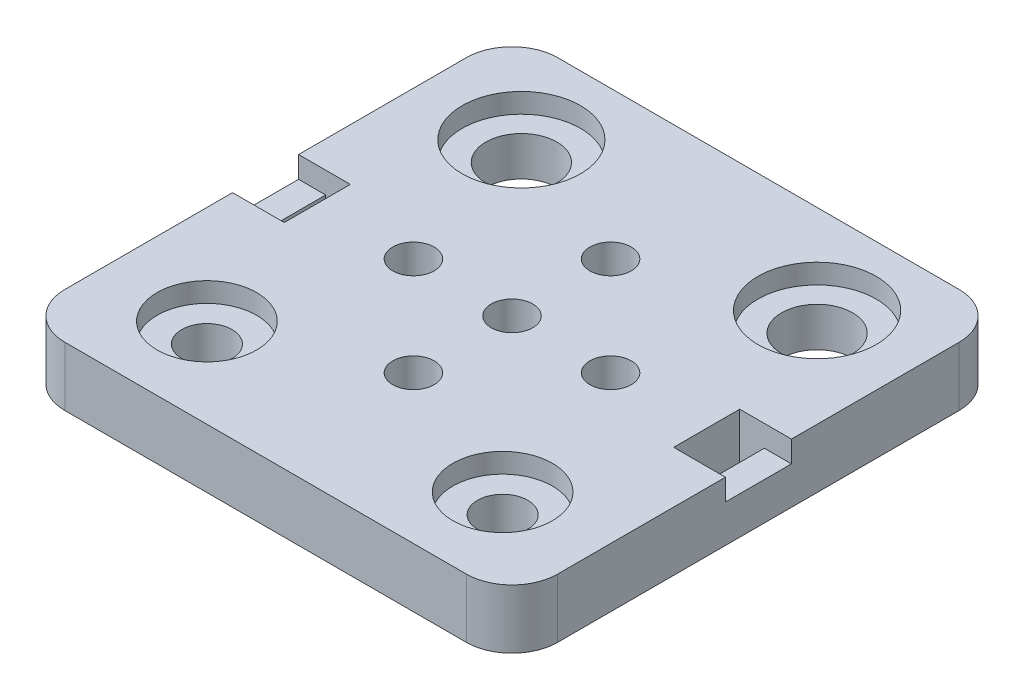
ISO-10303-21;
HEADER;
FILE_DESCRIPTION(('STEP AP214'),'2;1');
FILE_NAME('part.step','',(''),(''),'','','');
FILE_SCHEMA(('AUTOMOTIVE_DESIGN { 1 0 10303 214 1 1 1 1 }'));
ENDSEC;
DATA;
#1=APPLICATION_CONTEXT('core data for automotive mechanical design processes');
#2=APPLICATION_PROTOCOL_DEFINITION('international standard','automotive_design',2000,#1);
#3=PRODUCT_CONTEXT('',#1,'mechanical');
#4=PRODUCT('Part','Part','',(#3));
#5=PRODUCT_RELATED_PRODUCT_CATEGORY('part','',(#4));
#6=PRODUCT_DEFINITION_FORMATION('','',#4);
#7=PRODUCT_DEFINITION_CONTEXT('part definition',#1,'design');
#8=PRODUCT_DEFINITION('design','',#6,#7);
#9=PRODUCT_DEFINITION_SHAPE('','',#8);
#10=(LENGTH_UNIT() NAMED_UNIT(*) SI_UNIT(.MILLI.,.METRE.));
#11=(NAMED_UNIT(*) PLANE_ANGLE_UNIT() SI_UNIT($,.RADIAN.));
#12=(NAMED_UNIT(*) SI_UNIT($,.STERADIAN.) SOLID_ANGLE_UNIT());
#13=UNCERTAINTY_MEASURE_WITH_UNIT(LENGTH_MEASURE(1.E-05),#10,'distance_accuracy_value','');
#14=(GEOMETRIC_REPRESENTATION_CONTEXT(3) GLOBAL_UNCERTAINTY_ASSIGNED_CONTEXT((#13)) GLOBAL_UNIT_ASSIGNED_CONTEXT((#10,
#11,#12)) REPRESENTATION_CONTEXT('',''));
#15=CARTESIAN_POINT('',(0.,0.,0.));
#16=DIRECTION('',(0.,0.,1.));
#17=DIRECTION('',(1.,0.,0.));
#18=AXIS2_PLACEMENT_3D('',#15,#16,#17);
#19=CARTESIAN_POINT('',(-15.,6.,15.95));
#20=DIRECTION('',(0.,-1.,0.));
#21=DIRECTION('',(0.,0.,-1.));
#22=AXIS2_PLACEMENT_3D('',#19,#20,#21);
#23=CYLINDRICAL_SURFACE('',#22,2.55);
#24=CARTESIAN_POINT('',(-15.,0.,15.95));
#25=DIRECTION('',(0.,1.,0.));
#26=DIRECTION('',(0.,0.,-1.));
#27=AXIS2_PLACEMENT_3D('',#24,#25,#26);
#28=CIRCLE('',#27,2.55);
#29=CARTESIAN_POINT('',(-15.,0.,13.4));
#30=VERTEX_POINT('',#29);
#31=EDGE_CURVE('E325',#30,#30,#28,.T.);
#32=ORIENTED_EDGE('',*,*,#31,.F.);
#33=EDGE_LOOP('',(#32));
#34=FACE_BOUND('',#33,.T.);
#35=CARTESIAN_POINT('',(-15.,4.,15.95));
#36=DIRECTION('',(0.,1.,0.));
#37=DIRECTION('',(0.,0.,1.));
#38=AXIS2_PLACEMENT_3D('',#35,#36,#37);
#39=CIRCLE('',#38,2.55);
#40=CARTESIAN_POINT('',(-15.,4.,18.5));
#41=VERTEX_POINT('',#40);
#42=EDGE_CURVE('E40',#41,#41,#39,.T.);
#43=ORIENTED_EDGE('',*,*,#42,.T.);
#44=EDGE_LOOP('',(#43));
#45=FACE_BOUND('',#44,.T.);
#46=ADVANCED_FACE('F36',(#34,#45),#23,.F.);
#47=CARTESIAN_POINT('',(15.,6.,15.95));
#48=DIRECTION('',(0.,-1.,0.));
#49=DIRECTION('',(0.,0.,-1.));
#50=AXIS2_PLACEMENT_3D('',#47,#48,#49);
#51=CYLINDRICAL_SURFACE('',#50,2.55);
#52=CARTESIAN_POINT('',(15.,0.,15.95));
#53=DIRECTION('',(0.,1.,0.));
#54=DIRECTION('',(0.,0.,1.));
#55=AXIS2_PLACEMENT_3D('',#52,#53,#54);
#56=CIRCLE('',#55,2.55);
#57=CARTESIAN_POINT('',(15.,0.,18.5));
#58=VERTEX_POINT('',#57);
#59=EDGE_CURVE('E328',#58,#58,#56,.T.);
#60=ORIENTED_EDGE('',*,*,#59,.F.);
#61=EDGE_LOOP('',(#60));
#62=FACE_BOUND('',#61,.T.);
#63=CARTESIAN_POINT('',(15.,4.,15.95));
#64=DIRECTION('',(0.,1.,0.));
#65=DIRECTION('',(0.,0.,1.));
#66=AXIS2_PLACEMENT_3D('',#63,#64,#65);
#67=CIRCLE('',#66,2.55);
#68=CARTESIAN_POINT('',(15.,4.,18.5));
#69=VERTEX_POINT('',#68);
#70=EDGE_CURVE('E277',#69,#69,#67,.T.);
#71=ORIENTED_EDGE('',*,*,#70,.T.);
#72=EDGE_LOOP('',(#71));
#73=FACE_BOUND('',#72,.T.);
#74=ADVANCED_FACE('F401',(#62,#73),#51,.F.);
#75=CARTESIAN_POINT('',(15.,6.,-15.95));
#76=DIRECTION('',(0.,-1.,0.));
#77=DIRECTION('',(0.,0.,-1.));
#78=AXIS2_PLACEMENT_3D('',#75,#76,#77);
#79=CYLINDRICAL_SURFACE('',#78,3.6);
#80=CARTESIAN_POINT('',(15.,0.,-15.95));
#81=DIRECTION('',(0.,1.,0.));
#82=DIRECTION('',(0.,0.,-1.));
#83=AXIS2_PLACEMENT_3D('',#80,#81,#82);
#84=CIRCLE('',#83,3.6);
#85=CARTESIAN_POINT('',(15.,0.,-19.55));
#86=VERTEX_POINT('',#85);
#87=EDGE_CURVE('E331',#86,#86,#84,.T.);
#88=ORIENTED_EDGE('',*,*,#87,.F.);
#89=EDGE_LOOP('',(#88));
#90=FACE_BOUND('',#89,.T.);
#91=CARTESIAN_POINT('',(15.,4.,-15.95));
#92=DIRECTION('',(0.,1.,0.));
#93=DIRECTION('',(0.,0.,1.));
#94=AXIS2_PLACEMENT_3D('',#91,#92,#93);
#95=CIRCLE('',#94,3.6);
#96=CARTESIAN_POINT('',(15.,4.,-12.35));
#97=VERTEX_POINT('',#96);
#98=EDGE_CURVE('E284',#97,#97,#95,.T.);
#99=ORIENTED_EDGE('',*,*,#98,.T.);
#100=EDGE_LOOP('',(#99));
#101=FACE_BOUND('',#100,.T.);
#102=ADVANCED_FACE('F460',(#90,#101),#79,.F.);
#103=CARTESIAN_POINT('',(-15.,6.,-15.95));
#104=DIRECTION('',(0.,-1.,0.));
#105=DIRECTION('',(0.,0.,-1.));
#106=AXIS2_PLACEMENT_3D('',#103,#104,#105);
#107=CYLINDRICAL_SURFACE('',#106,3.6);
#108=CARTESIAN_POINT('',(-15.,0.,-15.95));
#109=DIRECTION('',(0.,1.,0.));
#110=DIRECTION('',(0.,0.,1.));
#111=AXIS2_PLACEMENT_3D('',#108,#109,#110);
#112=CIRCLE('',#111,3.6);
#113=CARTESIAN_POINT('',(-15.,0.,-12.35));
#114=VERTEX_POINT('',#113);
#115=EDGE_CURVE('E334',#114,#114,#112,.T.);
#116=ORIENTED_EDGE('',*,*,#115,.F.);
#117=EDGE_LOOP('',(#116));
#118=FACE_BOUND('',#117,.T.);
#119=CARTESIAN_POINT('',(-15.,4.,-15.95));
#120=DIRECTION('',(0.,1.,0.));
#121=DIRECTION('',(0.,0.,1.));
#122=AXIS2_PLACEMENT_3D('',#119,#120,#121);
#123=CIRCLE('',#122,3.6);
#124=CARTESIAN_POINT('',(-15.,4.,-12.35));
#125=VERTEX_POINT('',#124);
#126=EDGE_CURVE('E291',#125,#125,#123,.T.);
#127=ORIENTED_EDGE('',*,*,#126,.T.);
#128=EDGE_LOOP('',(#127));
#129=FACE_BOUND('',#128,.T.);
#130=ADVANCED_FACE('F420',(#118,#129),#107,.F.);
#131=CARTESIAN_POINT('',(-20.365,6.,-20.365));
#132=DIRECTION('',(0.,1.,0.));
#133=DIRECTION('',(0.,0.,1.));
#134=AXIS2_PLACEMENT_3D('',#131,#132,#133);
#135=PLANE('',#134);
#136=DIRECTION('',(-1.,0.,0.));
#137=VECTOR('',#136,1.);
#138=CARTESIAN_POINT('',(25.,6.,-3.35));
#139=LINE('',#138,#137);
#140=CARTESIAN_POINT('',(25.,6.,-3.35));
#141=VERTEX_POINT('',#140);
#142=CARTESIAN_POINT('',(19.75,6.,-3.35));
#143=VERTEX_POINT('',#142);
#144=EDGE_CURVE('E182',#141,#143,#139,.T.);
#145=ORIENTED_EDGE('',*,*,#144,.F.);
#146=DIRECTION('',(0.,0.,-1.));
#147=VECTOR('',#146,1.);
#148=CARTESIAN_POINT('',(25.,6.,20.365));
#149=LINE('',#148,#147);
#150=CARTESIAN_POINT('',(25.,6.,-20.365));
#151=VERTEX_POINT('',#150);
#152=EDGE_CURVE('E352',#141,#151,#149,.T.);
#153=ORIENTED_EDGE('',*,*,#152,.T.);
#154=CARTESIAN_POINT('',(20.365,6.,-20.365));
#155=DIRECTION('',(0.,1.,0.));
#156=DIRECTION('',(0.,0.,1.));
#157=AXIS2_PLACEMENT_3D('',#154,#155,#156);
#158=CIRCLE('',#157,4.635);
#159=CARTESIAN_POINT('',(20.365,6.,-25.));
#160=VERTEX_POINT('',#159);
#161=EDGE_CURVE('E356',#151,#160,#158,.T.);
#162=ORIENTED_EDGE('',*,*,#161,.T.);
#163=DIRECTION('',(-1.,0.,0.));
#164=VECTOR('',#163,1.);
#165=CARTESIAN_POINT('',(20.365,6.,-25.));
#166=LINE('',#165,#164);
#167=CARTESIAN_POINT('',(-20.365,6.,-25.));
#168=VERTEX_POINT('',#167);
#169=EDGE_CURVE('E358',#160,#168,#166,.T.);
#170=ORIENTED_EDGE('',*,*,#169,.T.);
#171=CARTESIAN_POINT('',(-20.365,6.,-20.365));
#172=DIRECTION('',(0.,1.,0.));
#173=DIRECTION('',(0.,0.,1.));
#174=AXIS2_PLACEMENT_3D('',#171,#172,#173);
#175=CIRCLE('',#174,4.635);
#176=CARTESIAN_POINT('',(-25.,6.,-20.365));
#177=VERTEX_POINT('',#176);
#178=EDGE_CURVE('E338',#168,#177,#175,.T.);
#179=ORIENTED_EDGE('',*,*,#178,.T.);
#180=DIRECTION('',(0.,0.,1.));
#181=VECTOR('',#180,1.);
#182=CARTESIAN_POINT('',(-25.,6.,20.365));
#183=LINE('',#182,#181);
#184=CARTESIAN_POINT('',(-25.,6.,-3.35));
#185=VERTEX_POINT('',#184);
#186=EDGE_CURVE('E343',#177,#185,#183,.T.);
#187=ORIENTED_EDGE('',*,*,#186,.T.);
#188=DIRECTION('',(-1.,0.,0.));
#189=VECTOR('',#188,1.);
#190=CARTESIAN_POINT('',(-25.,6.,-3.35));
#191=LINE('',#190,#189);
#192=CARTESIAN_POINT('',(-19.75,6.,-3.35));
#193=VERTEX_POINT('',#192);
#194=EDGE_CURVE('E248',#193,#185,#191,.T.);
#195=ORIENTED_EDGE('',*,*,#194,.F.);
#196=DIRECTION('',(0.,0.,-1.));
#197=VECTOR('',#196,1.);
#198=CARTESIAN_POINT('',(-19.75,6.,-3.35));
#199=LINE('',#198,#197);
#200=CARTESIAN_POINT('',(-19.75,6.,3.35));
#201=VERTEX_POINT('',#200);
#202=EDGE_CURVE('E256',#201,#193,#199,.T.);
#203=ORIENTED_EDGE('',*,*,#202,.F.);
#204=DIRECTION('',(1.,0.,0.));
#205=VECTOR('',#204,1.);
#206=CARTESIAN_POINT('',(-25.,6.,3.35));
#207=LINE('',#206,#205);
#208=CARTESIAN_POINT('',(-25.,6.,3.35));
#209=VERTEX_POINT('',#208);
#210=EDGE_CURVE('E239',#209,#201,#207,.T.);
#211=ORIENTED_EDGE('',*,*,#210,.F.);
#212=CARTESIAN_POINT('',(-25.,6.,20.365));
#213=VERTEX_POINT('',#212);
#214=EDGE_CURVE('E341',#209,#213,#183,.T.);
#215=ORIENTED_EDGE('',*,*,#214,.T.);
#216=CARTESIAN_POINT('',(-20.365,6.,20.365));
#217=DIRECTION('',(0.,1.,0.));
#218=DIRECTION('',(0.,0.,-1.));
#219=AXIS2_PLACEMENT_3D('',#216,#217,#218);
#220=CIRCLE('',#219,4.635);
#221=CARTESIAN_POINT('',(-20.365,6.,25.));
#222=VERTEX_POINT('',#221);
#223=EDGE_CURVE('E346',#213,#222,#220,.T.);
#224=ORIENTED_EDGE('',*,*,#223,.T.);
#225=DIRECTION('',(1.,0.,0.));
#226=VECTOR('',#225,1.);
#227=CARTESIAN_POINT('',(20.365,6.,25.));
#228=LINE('',#227,#226);
#229=CARTESIAN_POINT('',(20.365,6.,25.));
#230=VERTEX_POINT('',#229);
#231=EDGE_CURVE('E348',#222,#230,#228,.T.);
#232=ORIENTED_EDGE('',*,*,#231,.T.);
#233=CARTESIAN_POINT('',(20.365,6.,20.365));
#234=DIRECTION('',(0.,1.,0.));
#235=DIRECTION('',(0.,0.,1.));
#236=AXIS2_PLACEMENT_3D('',#233,#234,#235);
#237=CIRCLE('',#236,4.635);
#238=CARTESIAN_POINT('',(25.,6.,20.365));
#239=VERTEX_POINT('',#238);
#240=EDGE_CURVE('E350',#230,#239,#237,.T.);
#241=ORIENTED_EDGE('',*,*,#240,.T.);
#242=CARTESIAN_POINT('',(25.,6.,3.35));
#243=VERTEX_POINT('',#242);
#244=EDGE_CURVE('E353',#239,#243,#149,.T.);
#245=ORIENTED_EDGE('',*,*,#244,.T.);
#246=DIRECTION('',(1.,0.,0.));
#247=VECTOR('',#246,1.);
#248=CARTESIAN_POINT('',(25.,6.,3.35));
#249=LINE('',#248,#247);
#250=CARTESIAN_POINT('',(19.75,6.,3.35));
#251=VERTEX_POINT('',#250);
#252=EDGE_CURVE('E229',#251,#243,#249,.T.);
#253=ORIENTED_EDGE('',*,*,#252,.F.);
#254=DIRECTION('',(0.,0.,1.));
#255=VECTOR('',#254,1.);
#256=CARTESIAN_POINT('',(19.75,6.,-3.35));
#257=LINE('',#256,#255);
#258=EDGE_CURVE('E234',#143,#251,#257,.T.);
#259=ORIENTED_EDGE('',*,*,#258,.F.);
#260=EDGE_LOOP('',(#145,#153,#162,#170,#179,#187,#195,#203,#211,#215,#224,#232,#241,#245,#253,#259));
#261=FACE_BOUND('',#260,.T.);
#262=CARTESIAN_POINT('',(-15.,6.,15.95));
#263=DIRECTION('',(0.,1.,0.));
#264=DIRECTION('',(0.,0.,1.));
#265=AXIS2_PLACEMENT_3D('',#262,#263,#264);
#266=CIRCLE('',#265,5.05);
#267=CARTESIAN_POINT('',(-15.,6.,21.));
#268=VERTEX_POINT('',#267);
#269=EDGE_CURVE('E263',#268,#268,#266,.T.);
#270=ORIENTED_EDGE('',*,*,#269,.F.);
#271=EDGE_LOOP('',(#270));
#272=FACE_BOUND('',#271,.T.);
#273=CARTESIAN_POINT('',(15.,6.,15.95));
#274=DIRECTION('',(0.,1.,0.));
#275=DIRECTION('',(0.,0.,1.));
#276=AXIS2_PLACEMENT_3D('',#273,#274,#275);
#277=CIRCLE('',#276,5.05);
#278=CARTESIAN_POINT('',(15.,6.,21.));
#279=VERTEX_POINT('',#278);
#280=EDGE_CURVE('E278',#279,#279,#277,.T.);
#281=ORIENTED_EDGE('',*,*,#280,.F.);
#282=EDGE_LOOP('',(#281));
#283=FACE_BOUND('',#282,.T.);
#284=CARTESIAN_POINT('',(15.,6.,-15.95));
#285=DIRECTION('',(0.,1.,0.));
#286=DIRECTION('',(0.,0.,1.));
#287=AXIS2_PLACEMENT_3D('',#284,#285,#286);
#288=CIRCLE('',#287,6.00000000000001);
#289=CARTESIAN_POINT('',(15.,6.,-9.94999999999998));
#290=VERTEX_POINT('',#289);
#291=EDGE_CURVE('E285',#290,#290,#288,.T.);
#292=ORIENTED_EDGE('',*,*,#291,.F.);
#293=EDGE_LOOP('',(#292));
#294=FACE_BOUND('',#293,.T.);
#295=CARTESIAN_POINT('',(-15.,6.,-15.95));
#296=DIRECTION('',(0.,1.,0.));
#297=DIRECTION('',(0.,0.,1.));
#298=AXIS2_PLACEMENT_3D('',#295,#296,#297);
#299=CIRCLE('',#298,6.);
#300=CARTESIAN_POINT('',(-15.,6.,-9.94999999999998));
#301=VERTEX_POINT('',#300);
#302=EDGE_CURVE('E292',#301,#301,#299,.T.);
#303=ORIENTED_EDGE('',*,*,#302,.F.);
#304=EDGE_LOOP('',(#303));
#305=FACE_BOUND('',#304,.T.);
#306=CARTESIAN_POINT('',(0.,6.,-10.));
#307=DIRECTION('',(0.,1.,0.));
#308=DIRECTION('',(0.,0.,1.));
#309=AXIS2_PLACEMENT_3D('',#306,#307,#308);
#310=CIRCLE('',#309,2.1);
#311=CARTESIAN_POINT('',(0.,6.,-7.9));
#312=VERTEX_POINT('',#311);
#313=EDGE_CURVE('E295',#312,#312,#310,.T.);
#314=ORIENTED_EDGE('',*,*,#313,.F.);
#315=EDGE_LOOP('',(#314));
#316=FACE_BOUND('',#315,.T.);
#317=CARTESIAN_POINT('',(-10.,6.,0.));
#318=DIRECTION('',(0.,1.,0.));
#319=DIRECTION('',(0.,0.,1.));
#320=AXIS2_PLACEMENT_3D('',#317,#318,#319);
#321=CIRCLE('',#320,2.1);
#322=CARTESIAN_POINT('',(-10.,6.,2.1));
#323=VERTEX_POINT('',#322);
#324=EDGE_CURVE('E301',#323,#323,#321,.T.);
#325=ORIENTED_EDGE('',*,*,#324,.F.);
#326=EDGE_LOOP('',(#325));
#327=FACE_BOUND('',#326,.T.);
#328=CARTESIAN_POINT('',(0.,6.,0.));
#329=DIRECTION('',(0.,1.,0.));
#330=DIRECTION('',(0.,0.,1.));
#331=AXIS2_PLACEMENT_3D('',#328,#329,#330);
#332=CIRCLE('',#331,2.1);
#333=CARTESIAN_POINT('',(0.,6.,2.1));
#334=VERTEX_POINT('',#333);
#335=EDGE_CURVE('E307',#334,#334,#332,.T.);
#336=ORIENTED_EDGE('',*,*,#335,.F.);
#337=EDGE_LOOP('',(#336));
#338=FACE_BOUND('',#337,.T.);
#339=CARTESIAN_POINT('',(0.,6.,10.));
#340=DIRECTION('',(0.,1.,0.));
#341=DIRECTION('',(0.,0.,1.));
#342=AXIS2_PLACEMENT_3D('',#339,#340,#341);
#343=CIRCLE('',#342,2.1);
#344=CARTESIAN_POINT('',(0.,6.,12.1));
#345=VERTEX_POINT('',#344);
#346=EDGE_CURVE('E313',#345,#345,#343,.T.);
#347=ORIENTED_EDGE('',*,*,#346,.F.);
#348=EDGE_LOOP('',(#347));
#349=FACE_BOUND('',#348,.T.);
#350=CARTESIAN_POINT('',(10.,6.,0.));
#351=DIRECTION('',(0.,1.,0.));
#352=DIRECTION('',(0.,0.,1.));
#353=AXIS2_PLACEMENT_3D('',#350,#351,#352);
#354=CIRCLE('',#353,2.1);
#355=CARTESIAN_POINT('',(10.,6.,2.1));
#356=VERTEX_POINT('',#355);
#357=EDGE_CURVE('E319',#356,#356,#354,.T.);
#358=ORIENTED_EDGE('',*,*,#357,.F.);
#359=EDGE_LOOP('',(#358));
#360=FACE_BOUND('',#359,.T.);
#361=ADVANCED_FACE('F417',(#261,#272,#283,#294,#305,#316,#327,#338,#349,#360),#135,.T.);
#362=CARTESIAN_POINT('',(-20.365,0.,-20.365));
#363=DIRECTION('',(0.,1.,0.));
#364=DIRECTION('',(0.,0.,1.));
#365=AXIS2_PLACEMENT_3D('',#362,#363,#364);
#366=PLANE('',#365);
#367=DIRECTION('',(0.,0.,-1.));
#368=VECTOR('',#367,1.);
#369=CARTESIAN_POINT('',(22.25,0.,-3.35));
#370=LINE('',#369,#368);
#371=CARTESIAN_POINT('',(22.25,0.,3.35));
#372=VERTEX_POINT('',#371);
#373=CARTESIAN_POINT('',(22.25,0.,-3.35));
#374=VERTEX_POINT('',#373);
#375=EDGE_CURVE('E196',#372,#374,#370,.T.);
#376=ORIENTED_EDGE('',*,*,#375,.T.);
#377=DIRECTION('',(-1.,0.,0.));
#378=VECTOR('',#377,1.);
#379=CARTESIAN_POINT('',(19.75,0.,-3.35));
#380=LINE('',#379,#378);
#381=CARTESIAN_POINT('',(19.75,0.,-3.35));
#382=VERTEX_POINT('',#381);
#383=EDGE_CURVE('E179',#374,#382,#380,.T.);
#384=ORIENTED_EDGE('',*,*,#383,.T.);
#385=DIRECTION('',(0.,0.,1.));
#386=VECTOR('',#385,1.);
#387=CARTESIAN_POINT('',(19.75,0.,-3.35));
#388=LINE('',#387,#386);
#389=CARTESIAN_POINT('',(19.75,0.,3.35));
#390=VERTEX_POINT('',#389);
#391=EDGE_CURVE('E187',#382,#390,#388,.T.);
#392=ORIENTED_EDGE('',*,*,#391,.T.);
#393=DIRECTION('',(1.,0.,0.));
#394=VECTOR('',#393,1.);
#395=CARTESIAN_POINT('',(19.75,0.,3.35));
#396=LINE('',#395,#394);
#397=EDGE_CURVE('E191',#390,#372,#396,.T.);
#398=ORIENTED_EDGE('',*,*,#397,.T.);
#399=EDGE_LOOP('',(#376,#384,#392,#398));
#400=FACE_BOUND('',#399,.T.);
#401=DIRECTION('',(1.,0.,0.));
#402=VECTOR('',#401,1.);
#403=CARTESIAN_POINT('',(-19.75,0.,3.35));
#404=LINE('',#403,#402);
#405=CARTESIAN_POINT('',(-22.25,0.,3.35));
#406=VERTEX_POINT('',#405);
#407=CARTESIAN_POINT('',(-19.75,0.,3.35));
#408=VERTEX_POINT('',#407);
#409=EDGE_CURVE('E216',#406,#408,#404,.T.);
#410=ORIENTED_EDGE('',*,*,#409,.T.);
#411=DIRECTION('',(0.,0.,-1.));
#412=VECTOR('',#411,1.);
#413=CARTESIAN_POINT('',(-19.75,0.,-3.35));
#414=LINE('',#413,#412);
#415=CARTESIAN_POINT('',(-19.75,0.,-3.35));
#416=VERTEX_POINT('',#415);
#417=EDGE_CURVE('E209',#408,#416,#414,.T.);
#418=ORIENTED_EDGE('',*,*,#417,.T.);
#419=DIRECTION('',(-1.,0.,0.));
#420=VECTOR('',#419,1.);
#421=CARTESIAN_POINT('',(-19.75,0.,-3.35));
#422=LINE('',#421,#420);
#423=CARTESIAN_POINT('',(-22.25,0.,-3.35));
#424=VERTEX_POINT('',#423);
#425=EDGE_CURVE('E212',#416,#424,#422,.T.);
#426=ORIENTED_EDGE('',*,*,#425,.T.);
#427=DIRECTION('',(0.,0.,1.));
#428=VECTOR('',#427,1.);
#429=CARTESIAN_POINT('',(-22.25,0.,-3.35));
#430=LINE('',#429,#428);
#431=EDGE_CURVE('E61',#424,#406,#430,.T.);
#432=ORIENTED_EDGE('',*,*,#431,.T.);
#433=EDGE_LOOP('',(#410,#418,#426,#432));
#434=FACE_BOUND('',#433,.T.);
#435=CARTESIAN_POINT('',(0.,0.,-10.));
#436=DIRECTION('',(0.,1.,0.));
#437=DIRECTION('',(0.,0.,1.));
#438=AXIS2_PLACEMENT_3D('',#435,#436,#437);
#439=CIRCLE('',#438,2.1);
#440=CARTESIAN_POINT('',(0.,0.,-7.9));
#441=VERTEX_POINT('',#440);
#442=EDGE_CURVE('E298',#441,#441,#439,.T.);
#443=ORIENTED_EDGE('',*,*,#442,.T.);
#444=EDGE_LOOP('',(#443));
#445=FACE_BOUND('',#444,.T.);
#446=CARTESIAN_POINT('',(-10.,0.,0.));
#447=DIRECTION('',(0.,1.,0.));
#448=DIRECTION('',(0.,0.,1.));
#449=AXIS2_PLACEMENT_3D('',#446,#447,#448);
#450=CIRCLE('',#449,2.1);
#451=CARTESIAN_POINT('',(-10.,0.,2.1));
#452=VERTEX_POINT('',#451);
#453=EDGE_CURVE('E304',#452,#452,#450,.T.);
#454=ORIENTED_EDGE('',*,*,#453,.T.);
#455=EDGE_LOOP('',(#454));
#456=FACE_BOUND('',#455,.T.);
#457=CARTESIAN_POINT('',(0.,0.,0.));
#458=DIRECTION('',(0.,1.,0.));
#459=DIRECTION('',(0.,0.,1.));
#460=AXIS2_PLACEMENT_3D('',#457,#458,#459);
#461=CIRCLE('',#460,2.1);
#462=CARTESIAN_POINT('',(0.,0.,2.1));
#463=VERTEX_POINT('',#462);
#464=EDGE_CURVE('E310',#463,#463,#461,.T.);
#465=ORIENTED_EDGE('',*,*,#464,.T.);
#466=EDGE_LOOP('',(#465));
#467=FACE_BOUND('',#466,.T.);
#468=CARTESIAN_POINT('',(0.,0.,10.));
#469=DIRECTION('',(0.,1.,0.));
#470=DIRECTION('',(0.,0.,1.));
#471=AXIS2_PLACEMENT_3D('',#468,#469,#470);
#472=CIRCLE('',#471,2.1);
#473=CARTESIAN_POINT('',(0.,0.,12.1));
#474=VERTEX_POINT('',#473);
#475=EDGE_CURVE('E316',#474,#474,#472,.T.);
#476=ORIENTED_EDGE('',*,*,#475,.T.);
#477=EDGE_LOOP('',(#476));
#478=FACE_BOUND('',#477,.T.);
#479=CARTESIAN_POINT('',(10.,0.,0.));
#480=DIRECTION('',(0.,1.,0.));
#481=DIRECTION('',(0.,0.,1.));
#482=AXIS2_PLACEMENT_3D('',#479,#480,#481);
#483=CIRCLE('',#482,2.1);
#484=CARTESIAN_POINT('',(10.,0.,2.1));
#485=VERTEX_POINT('',#484);
#486=EDGE_CURVE('E322',#485,#485,#483,.T.);
#487=ORIENTED_EDGE('',*,*,#486,.T.);
#488=EDGE_LOOP('',(#487));
#489=FACE_BOUND('',#488,.T.);
#490=ORIENTED_EDGE('',*,*,#59,.T.);
#491=EDGE_LOOP('',(#490));
#492=FACE_BOUND('',#491,.T.);
#493=ORIENTED_EDGE('',*,*,#115,.T.);
#494=EDGE_LOOP('',(#493));
#495=FACE_BOUND('',#494,.T.);
#496=CARTESIAN_POINT('',(-20.365,0.,-20.365));
#497=DIRECTION('',(0.,1.,0.));
#498=DIRECTION('',(0.,0.,1.));
#499=AXIS2_PLACEMENT_3D('',#496,#497,#498);
#500=CIRCLE('',#499,4.635);
#501=CARTESIAN_POINT('',(-20.365,0.,-25.));
#502=VERTEX_POINT('',#501);
#503=CARTESIAN_POINT('',(-25.,0.,-20.365));
#504=VERTEX_POINT('',#503);
#505=EDGE_CURVE('E337',#502,#504,#500,.T.);
#506=ORIENTED_EDGE('',*,*,#505,.F.);
#507=DIRECTION('',(-1.,0.,0.));
#508=VECTOR('',#507,1.);
#509=CARTESIAN_POINT('',(20.365,0.,-25.));
#510=LINE('',#509,#508);
#511=CARTESIAN_POINT('',(20.365,0.,-25.));
#512=VERTEX_POINT('',#511);
#513=EDGE_CURVE('E342',#512,#502,#510,.T.);
#514=ORIENTED_EDGE('',*,*,#513,.F.);
#515=CARTESIAN_POINT('',(20.365,0.,-20.365));
#516=DIRECTION('',(0.,1.,0.));
#517=DIRECTION('',(0.,0.,1.));
#518=AXIS2_PLACEMENT_3D('',#515,#516,#517);
#519=CIRCLE('',#518,4.635);
#520=CARTESIAN_POINT('',(25.,0.,-20.365));
#521=VERTEX_POINT('',#520);
#522=EDGE_CURVE('E373',#521,#512,#519,.T.);
#523=ORIENTED_EDGE('',*,*,#522,.F.);
#524=DIRECTION('',(0.,0.,-1.));
#525=VECTOR('',#524,1.);
#526=CARTESIAN_POINT('',(25.,0.,20.365));
#527=LINE('',#526,#525);
#528=CARTESIAN_POINT('',(25.,0.,20.365));
#529=VERTEX_POINT('',#528);
#530=EDGE_CURVE('E371',#529,#521,#527,.T.);
#531=ORIENTED_EDGE('',*,*,#530,.F.);
#532=CARTESIAN_POINT('',(20.365,0.,20.365));
#533=DIRECTION('',(0.,1.,0.));
#534=DIRECTION('',(0.,0.,1.));
#535=AXIS2_PLACEMENT_3D('',#532,#533,#534);
#536=CIRCLE('',#535,4.635);
#537=CARTESIAN_POINT('',(20.365,0.,25.));
#538=VERTEX_POINT('',#537);
#539=EDGE_CURVE('E369',#538,#529,#536,.T.);
#540=ORIENTED_EDGE('',*,*,#539,.F.);
#541=DIRECTION('',(1.,0.,0.));
#542=VECTOR('',#541,1.);
#543=CARTESIAN_POINT('',(20.365,0.,25.));
#544=LINE('',#543,#542);
#545=CARTESIAN_POINT('',(-20.365,0.,25.));
#546=VERTEX_POINT('',#545);
#547=EDGE_CURVE('E367',#546,#538,#544,.T.);
#548=ORIENTED_EDGE('',*,*,#547,.F.);
#549=CARTESIAN_POINT('',(-20.365,0.,20.365));
#550=DIRECTION('',(0.,1.,0.));
#551=DIRECTION('',(0.,0.,-1.));
#552=AXIS2_PLACEMENT_3D('',#549,#550,#551);
#553=CIRCLE('',#552,4.635);
#554=CARTESIAN_POINT('',(-25.,0.,20.365));
#555=VERTEX_POINT('',#554);
#556=EDGE_CURVE('E365',#555,#546,#553,.T.);
#557=ORIENTED_EDGE('',*,*,#556,.F.);
#558=DIRECTION('',(0.,0.,1.));
#559=VECTOR('',#558,1.);
#560=CARTESIAN_POINT('',(-25.,0.,20.365));
#561=LINE('',#560,#559);
#562=EDGE_CURVE('E363',#504,#555,#561,.T.);
#563=ORIENTED_EDGE('',*,*,#562,.F.);
#564=EDGE_LOOP('',(#506,#514,#523,#531,#540,#548,#557,#563));
#565=FACE_BOUND('',#564,.T.);
#566=ORIENTED_EDGE('',*,*,#87,.T.);
#567=EDGE_LOOP('',(#566));
#568=FACE_BOUND('',#567,.T.);
#569=ORIENTED_EDGE('',*,*,#31,.T.);
#570=EDGE_LOOP('',(#569));
#571=FACE_BOUND('',#570,.T.);
#572=ADVANCED_FACE('F193',(#400,#434,#445,#456,#467,#478,#489,#492,#495,#565,#568,#571),#366,.F.);
#573=CARTESIAN_POINT('',(-20.365,6.,-20.365));
#574=DIRECTION('',(0.,-1.,0.));
#575=DIRECTION('',(0.,0.,-1.));
#576=AXIS2_PLACEMENT_3D('',#573,#574,#575);
#577=CYLINDRICAL_SURFACE('',#576,4.635);
#578=ORIENTED_EDGE('',*,*,#505,.T.);
#579=DIRECTION('',(0.,-1.,0.));
#580=VECTOR('',#579,1.);
#581=CARTESIAN_POINT('',(-25.,6.,-20.365));
#582=LINE('',#581,#580);
#583=EDGE_CURVE('E11',#177,#504,#582,.T.);
#584=ORIENTED_EDGE('',*,*,#583,.F.);
#585=ORIENTED_EDGE('',*,*,#178,.F.);
#586=DIRECTION('',(0.,-1.,0.));
#587=VECTOR('',#586,1.);
#588=CARTESIAN_POINT('',(-20.365,6.,-25.));
#589=LINE('',#588,#587);
#590=EDGE_CURVE('E360',#168,#502,#589,.T.);
#591=ORIENTED_EDGE('',*,*,#590,.T.);
#592=EDGE_LOOP('',(#578,#584,#585,#591));
#593=FACE_BOUND('',#592,.T.);
#594=ADVANCED_FACE('F38',(#593),#577,.T.);
#595=CARTESIAN_POINT('',(-25.,6.,20.365));
#596=DIRECTION('',(1.,0.,0.));
#597=DIRECTION('',(0.,0.,-1.));
#598=AXIS2_PLACEMENT_3D('',#595,#596,#597);
#599=PLANE('',#598);
#600=DIRECTION('',(0.,0.,1.));
#601=VECTOR('',#600,1.);
#602=CARTESIAN_POINT('',(-25.,3.82,-3.35));
#603=LINE('',#602,#601);
#604=CARTESIAN_POINT('',(-25.,3.82,-3.35));
#605=VERTEX_POINT('',#604);
#606=CARTESIAN_POINT('',(-25.,3.82,3.35));
#607=VERTEX_POINT('',#606);
#608=EDGE_CURVE('E244',#605,#607,#603,.T.);
#609=ORIENTED_EDGE('',*,*,#608,.F.);
#610=DIRECTION('',(0.,1.,0.));
#611=VECTOR('',#610,1.);
#612=CARTESIAN_POINT('',(-25.,3.82,-3.35));
#613=LINE('',#612,#611);
#614=EDGE_CURVE('E260',#605,#185,#613,.T.);
#615=ORIENTED_EDGE('',*,*,#614,.T.);
#616=ORIENTED_EDGE('',*,*,#186,.F.);
#617=ORIENTED_EDGE('',*,*,#583,.T.);
#618=ORIENTED_EDGE('',*,*,#562,.T.);
#619=DIRECTION('',(0.,-1.,0.));
#620=VECTOR('',#619,1.);
#621=CARTESIAN_POINT('',(-25.,6.,20.365));
#622=LINE('',#621,#620);
#623=EDGE_CURVE('E45',#213,#555,#622,.T.);
#624=ORIENTED_EDGE('',*,*,#623,.F.);
#625=ORIENTED_EDGE('',*,*,#214,.F.);
#626=DIRECTION('',(0.,1.,0.));
#627=VECTOR('',#626,1.);
#628=CARTESIAN_POINT('',(-25.,3.82,3.35));
#629=LINE('',#628,#627);
#630=EDGE_CURVE('E253',#607,#209,#629,.T.);
#631=ORIENTED_EDGE('',*,*,#630,.F.);
#632=EDGE_LOOP('',(#609,#615,#616,#617,#618,#624,#625,#631));
#633=FACE_BOUND('',#632,.T.);
#634=ADVANCED_FACE('F491',(#633),#599,.F.);
#635=CARTESIAN_POINT('',(-20.365,6.,20.365));
#636=DIRECTION('',(0.,-1.,0.));
#637=DIRECTION('',(0.,0.,-1.));
#638=AXIS2_PLACEMENT_3D('',#635,#636,#637);
#639=CYLINDRICAL_SURFACE('',#638,4.635);
#640=ORIENTED_EDGE('',*,*,#556,.T.);
#641=DIRECTION('',(0.,-1.,0.));
#642=VECTOR('',#641,1.);
#643=CARTESIAN_POINT('',(-20.365,6.,25.));
#644=LINE('',#643,#642);
#645=EDGE_CURVE('E390',#222,#546,#644,.T.);
#646=ORIENTED_EDGE('',*,*,#645,.F.);
#647=ORIENTED_EDGE('',*,*,#223,.F.);
#648=ORIENTED_EDGE('',*,*,#623,.T.);
#649=EDGE_LOOP('',(#640,#646,#647,#648));
#650=FACE_BOUND('',#649,.T.);
#651=ADVANCED_FACE('F488',(#650),#639,.T.);
#652=CARTESIAN_POINT('',(20.365,6.,25.));
#653=DIRECTION('',(0.,0.,-1.));
#654=DIRECTION('',(-1.,0.,0.));
#655=AXIS2_PLACEMENT_3D('',#652,#653,#654);
#656=PLANE('',#655);
#657=ORIENTED_EDGE('',*,*,#547,.T.);
#658=DIRECTION('',(0.,-1.,0.));
#659=VECTOR('',#658,1.);
#660=CARTESIAN_POINT('',(20.365,6.,25.));
#661=LINE('',#660,#659);
#662=EDGE_CURVE('E387',#230,#538,#661,.T.);
#663=ORIENTED_EDGE('',*,*,#662,.F.);
#664=ORIENTED_EDGE('',*,*,#231,.F.);
#665=ORIENTED_EDGE('',*,*,#645,.T.);
#666=EDGE_LOOP('',(#657,#663,#664,#665));
#667=FACE_BOUND('',#666,.T.);
#668=ADVANCED_FACE('F484',(#667),#656,.F.);
#669=CARTESIAN_POINT('',(20.365,6.,20.365));
#670=DIRECTION('',(0.,-1.,0.));
#671=DIRECTION('',(0.,0.,-1.));
#672=AXIS2_PLACEMENT_3D('',#669,#670,#671);
#673=CYLINDRICAL_SURFACE('',#672,4.635);
#674=ORIENTED_EDGE('',*,*,#539,.T.);
#675=DIRECTION('',(0.,-1.,0.));
#676=VECTOR('',#675,1.);
#677=CARTESIAN_POINT('',(25.,6.,20.365));
#678=LINE('',#677,#676);
#679=EDGE_CURVE('E384',#239,#529,#678,.T.);
#680=ORIENTED_EDGE('',*,*,#679,.F.);
#681=ORIENTED_EDGE('',*,*,#240,.F.);
#682=ORIENTED_EDGE('',*,*,#662,.T.);
#683=EDGE_LOOP('',(#674,#680,#681,#682));
#684=FACE_BOUND('',#683,.T.);
#685=ADVANCED_FACE('F480',(#684),#673,.T.);
#686=CARTESIAN_POINT('',(25.,6.,20.365));
#687=DIRECTION('',(-1.,0.,0.));
#688=DIRECTION('',(0.,0.,1.));
#689=AXIS2_PLACEMENT_3D('',#686,#687,#688);
#690=PLANE('',#689);
#691=ORIENTED_EDGE('',*,*,#152,.F.);
#692=DIRECTION('',(0.,1.,0.));
#693=VECTOR('',#692,1.);
#694=CARTESIAN_POINT('',(25.,3.82,-3.35));
#695=LINE('',#694,#693);
#696=CARTESIAN_POINT('',(25.,3.82,-3.35));
#697=VERTEX_POINT('',#696);
#698=EDGE_CURVE('E237',#697,#141,#695,.T.);
#699=ORIENTED_EDGE('',*,*,#698,.F.);
#700=DIRECTION('',(0.,0.,-1.));
#701=VECTOR('',#700,1.);
#702=CARTESIAN_POINT('',(25.,3.82,-3.35));
#703=LINE('',#702,#701);
#704=CARTESIAN_POINT('',(25.,3.82,3.35));
#705=VERTEX_POINT('',#704);
#706=EDGE_CURVE('E184',#705,#697,#703,.T.);
#707=ORIENTED_EDGE('',*,*,#706,.F.);
#708=DIRECTION('',(0.,1.,0.));
#709=VECTOR('',#708,1.);
#710=CARTESIAN_POINT('',(25.,3.82,3.35));
#711=LINE('',#710,#709);
#712=EDGE_CURVE('E240',#705,#243,#711,.T.);
#713=ORIENTED_EDGE('',*,*,#712,.T.);
#714=ORIENTED_EDGE('',*,*,#244,.F.);
#715=ORIENTED_EDGE('',*,*,#679,.T.);
#716=ORIENTED_EDGE('',*,*,#530,.T.);
#717=DIRECTION('',(0.,-1.,0.));
#718=VECTOR('',#717,1.);
#719=CARTESIAN_POINT('',(25.,6.,-20.365));
#720=LINE('',#719,#718);
#721=EDGE_CURVE('E381',#151,#521,#720,.T.);
#722=ORIENTED_EDGE('',*,*,#721,.F.);
#723=EDGE_LOOP('',(#691,#699,#707,#713,#714,#715,#716,#722));
#724=FACE_BOUND('',#723,.T.);
#725=ADVANCED_FACE('F476',(#724),#690,.F.);
#726=CARTESIAN_POINT('',(20.365,6.,-20.365));
#727=DIRECTION('',(0.,-1.,0.));
#728=DIRECTION('',(0.,0.,-1.));
#729=AXIS2_PLACEMENT_3D('',#726,#727,#728);
#730=CYLINDRICAL_SURFACE('',#729,4.635);
#731=ORIENTED_EDGE('',*,*,#522,.T.);
#732=DIRECTION('',(0.,-1.,0.));
#733=VECTOR('',#732,1.);
#734=CARTESIAN_POINT('',(20.365,6.,-25.));
#735=LINE('',#734,#733);
#736=EDGE_CURVE('E378',#160,#512,#735,.T.);
#737=ORIENTED_EDGE('',*,*,#736,.F.);
#738=ORIENTED_EDGE('',*,*,#161,.F.);
#739=ORIENTED_EDGE('',*,*,#721,.T.);
#740=EDGE_LOOP('',(#731,#737,#738,#739));
#741=FACE_BOUND('',#740,.T.);
#742=ADVANCED_FACE('F450',(#741),#730,.T.);
#743=CARTESIAN_POINT('',(20.365,6.,-25.));
#744=DIRECTION('',(0.,0.,1.));
#745=DIRECTION('',(1.,0.,0.));
#746=AXIS2_PLACEMENT_3D('',#743,#744,#745);
#747=PLANE('',#746);
#748=ORIENTED_EDGE('',*,*,#513,.T.);
#749=ORIENTED_EDGE('',*,*,#590,.F.);
#750=ORIENTED_EDGE('',*,*,#169,.F.);
#751=ORIENTED_EDGE('',*,*,#736,.T.);
#752=EDGE_LOOP('',(#748,#749,#750,#751));
#753=FACE_BOUND('',#752,.T.);
#754=ADVANCED_FACE('F440',(#753),#747,.F.);
#755=CARTESIAN_POINT('',(10.,6.,0.));
#756=DIRECTION('',(0.,1.,0.));
#757=DIRECTION('',(0.,0.,1.));
#758=AXIS2_PLACEMENT_3D('',#755,#756,#757);
#759=CYLINDRICAL_SURFACE('',#758,2.1);
#760=ORIENTED_EDGE('',*,*,#486,.F.);
#761=EDGE_LOOP('',(#760));
#762=FACE_BOUND('',#761,.T.);
#763=ORIENTED_EDGE('',*,*,#357,.T.);
#764=EDGE_LOOP('',(#763));
#765=FACE_BOUND('',#764,.T.);
#766=ADVANCED_FACE('F437',(#762,#765),#759,.F.);
#767=CARTESIAN_POINT('',(0.,6.,10.));
#768=DIRECTION('',(0.,1.,0.));
#769=DIRECTION('',(0.,0.,1.));
#770=AXIS2_PLACEMENT_3D('',#767,#768,#769);
#771=CYLINDRICAL_SURFACE('',#770,2.1);
#772=ORIENTED_EDGE('',*,*,#475,.F.);
#773=EDGE_LOOP('',(#772));
#774=FACE_BOUND('',#773,.T.);
#775=ORIENTED_EDGE('',*,*,#346,.T.);
#776=EDGE_LOOP('',(#775));
#777=FACE_BOUND('',#776,.T.);
#778=ADVANCED_FACE('F439',(#774,#777),#771,.F.);
#779=CARTESIAN_POINT('',(0.,6.,0.));
#780=DIRECTION('',(0.,1.,0.));
#781=DIRECTION('',(0.,0.,1.));
#782=AXIS2_PLACEMENT_3D('',#779,#780,#781);
#783=CYLINDRICAL_SURFACE('',#782,2.1);
#784=ORIENTED_EDGE('',*,*,#464,.F.);
#785=EDGE_LOOP('',(#784));
#786=FACE_BOUND('',#785,.T.);
#787=ORIENTED_EDGE('',*,*,#335,.T.);
#788=EDGE_LOOP('',(#787));
#789=FACE_BOUND('',#788,.T.);
#790=ADVANCED_FACE('F447',(#786,#789),#783,.F.);
#791=CARTESIAN_POINT('',(-10.,6.,0.));
#792=DIRECTION('',(0.,1.,0.));
#793=DIRECTION('',(0.,0.,1.));
#794=AXIS2_PLACEMENT_3D('',#791,#792,#793);
#795=CYLINDRICAL_SURFACE('',#794,2.1);
#796=ORIENTED_EDGE('',*,*,#453,.F.);
#797=EDGE_LOOP('',(#796));
#798=FACE_BOUND('',#797,.T.);
#799=ORIENTED_EDGE('',*,*,#324,.T.);
#800=EDGE_LOOP('',(#799));
#801=FACE_BOUND('',#800,.T.);
#802=ADVANCED_FACE('F575',(#798,#801),#795,.F.);
#803=CARTESIAN_POINT('',(0.,6.,-10.));
#804=DIRECTION('',(0.,1.,0.));
#805=DIRECTION('',(0.,0.,1.));
#806=AXIS2_PLACEMENT_3D('',#803,#804,#805);
#807=CYLINDRICAL_SURFACE('',#806,2.1);
#808=ORIENTED_EDGE('',*,*,#442,.F.);
#809=EDGE_LOOP('',(#808));
#810=FACE_BOUND('',#809,.T.);
#811=ORIENTED_EDGE('',*,*,#313,.T.);
#812=EDGE_LOOP('',(#811));
#813=FACE_BOUND('',#812,.T.);
#814=ADVANCED_FACE('F571',(#810,#813),#807,.F.);
#815=CARTESIAN_POINT('',(-15.,4.,-15.95));
#816=DIRECTION('',(0.,1.,0.));
#817=DIRECTION('',(0.,0.,1.));
#818=AXIS2_PLACEMENT_3D('',#815,#816,#817);
#819=CYLINDRICAL_SURFACE('',#818,6.);
#820=CARTESIAN_POINT('',(-15.,4.,-15.95));
#821=DIRECTION('',(0.,1.,0.));
#822=DIRECTION('',(0.,0.,1.));
#823=AXIS2_PLACEMENT_3D('',#820,#821,#822);
#824=CIRCLE('',#823,6.);
#825=CARTESIAN_POINT('',(-15.,4.,-9.94999999999998));
#826=VERTEX_POINT('',#825);
#827=EDGE_CURVE('E288',#826,#826,#824,.T.);
#828=ORIENTED_EDGE('',*,*,#827,.F.);
#829=EDGE_LOOP('',(#828));
#830=FACE_BOUND('',#829,.T.);
#831=ORIENTED_EDGE('',*,*,#302,.T.);
#832=EDGE_LOOP('',(#831));
#833=FACE_BOUND('',#832,.T.);
#834=ADVANCED_FACE('F567',(#830,#833),#819,.F.);
#835=CARTESIAN_POINT('',(-15.,4.,-15.95));
#836=DIRECTION('',(0.,1.,0.));
#837=DIRECTION('',(0.,0.,1.));
#838=AXIS2_PLACEMENT_3D('',#835,#836,#837);
#839=PLANE('',#838);
#840=ORIENTED_EDGE('',*,*,#126,.F.);
#841=EDGE_LOOP('',(#840));
#842=FACE_BOUND('',#841,.T.);
#843=ORIENTED_EDGE('',*,*,#827,.T.);
#844=EDGE_LOOP('',(#843));
#845=FACE_BOUND('',#844,.T.);
#846=ADVANCED_FACE('F563',(#842,#845),#839,.T.);
#847=CARTESIAN_POINT('',(15.,4.,-15.95));
#848=DIRECTION('',(0.,1.,0.));
#849=DIRECTION('',(0.,0.,1.));
#850=AXIS2_PLACEMENT_3D('',#847,#848,#849);
#851=CYLINDRICAL_SURFACE('',#850,6.00000000000001);
#852=CARTESIAN_POINT('',(15.,4.,-15.95));
#853=DIRECTION('',(0.,1.,0.));
#854=DIRECTION('',(0.,0.,1.));
#855=AXIS2_PLACEMENT_3D('',#852,#853,#854);
#856=CIRCLE('',#855,6.00000000000001);
#857=CARTESIAN_POINT('',(15.,4.,-9.94999999999998));
#858=VERTEX_POINT('',#857);
#859=EDGE_CURVE('E281',#858,#858,#856,.T.);
#860=ORIENTED_EDGE('',*,*,#859,.F.);
#861=EDGE_LOOP('',(#860));
#862=FACE_BOUND('',#861,.T.);
#863=ORIENTED_EDGE('',*,*,#291,.T.);
#864=EDGE_LOOP('',(#863));
#865=FACE_BOUND('',#864,.T.);
#866=ADVANCED_FACE('F559',(#862,#865),#851,.F.);
#867=CARTESIAN_POINT('',(15.,4.,-15.95));
#868=DIRECTION('',(0.,1.,0.));
#869=DIRECTION('',(0.,0.,1.));
#870=AXIS2_PLACEMENT_3D('',#867,#868,#869);
#871=PLANE('',#870);
#872=ORIENTED_EDGE('',*,*,#98,.F.);
#873=EDGE_LOOP('',(#872));
#874=FACE_BOUND('',#873,.T.);
#875=ORIENTED_EDGE('',*,*,#859,.T.);
#876=EDGE_LOOP('',(#875));
#877=FACE_BOUND('',#876,.T.);
#878=ADVANCED_FACE('F413',(#874,#877),#871,.T.);
#879=CARTESIAN_POINT('',(15.,4.,15.95));
#880=DIRECTION('',(0.,1.,0.));
#881=DIRECTION('',(0.,0.,1.));
#882=AXIS2_PLACEMENT_3D('',#879,#880,#881);
#883=CYLINDRICAL_SURFACE('',#882,5.05);
#884=CARTESIAN_POINT('',(15.,4.,15.95));
#885=DIRECTION('',(0.,1.,0.));
#886=DIRECTION('',(0.,0.,1.));
#887=AXIS2_PLACEMENT_3D('',#884,#885,#886);
#888=CIRCLE('',#887,5.05);
#889=CARTESIAN_POINT('',(15.,4.,21.));
#890=VERTEX_POINT('',#889);
#891=EDGE_CURVE('E274',#890,#890,#888,.T.);
#892=ORIENTED_EDGE('',*,*,#891,.F.);
#893=EDGE_LOOP('',(#892));
#894=FACE_BOUND('',#893,.T.);
#895=ORIENTED_EDGE('',*,*,#280,.T.);
#896=EDGE_LOOP('',(#895));
#897=FACE_BOUND('',#896,.T.);
#898=ADVANCED_FACE('F407',(#894,#897),#883,.F.);
#899=CARTESIAN_POINT('',(15.,4.,15.95));
#900=DIRECTION('',(0.,1.,0.));
#901=DIRECTION('',(0.,0.,1.));
#902=AXIS2_PLACEMENT_3D('',#899,#900,#901);
#903=PLANE('',#902);
#904=ORIENTED_EDGE('',*,*,#70,.F.);
#905=EDGE_LOOP('',(#904));
#906=FACE_BOUND('',#905,.T.);
#907=ORIENTED_EDGE('',*,*,#891,.T.);
#908=EDGE_LOOP('',(#907));
#909=FACE_BOUND('',#908,.T.);
#910=ADVANCED_FACE('F403',(#906,#909),#903,.T.);
#911=CARTESIAN_POINT('',(-15.,4.,15.95));
#912=DIRECTION('',(0.,1.,0.));
#913=DIRECTION('',(0.,0.,1.));
#914=AXIS2_PLACEMENT_3D('',#911,#912,#913);
#915=CYLINDRICAL_SURFACE('',#914,5.05);
#916=CARTESIAN_POINT('',(-15.,4.,15.95));
#917=DIRECTION('',(0.,1.,0.));
#918=DIRECTION('',(0.,0.,1.));
#919=AXIS2_PLACEMENT_3D('',#916,#917,#918);
#920=CIRCLE('',#919,5.05);
#921=CARTESIAN_POINT('',(-15.,4.,21.));
#922=VERTEX_POINT('',#921);
#923=EDGE_CURVE('E269',#922,#922,#920,.T.);
#924=ORIENTED_EDGE('',*,*,#923,.F.);
#925=EDGE_LOOP('',(#924));
#926=FACE_BOUND('',#925,.T.);
#927=ORIENTED_EDGE('',*,*,#269,.T.);
#928=EDGE_LOOP('',(#927));
#929=FACE_BOUND('',#928,.T.);
#930=ADVANCED_FACE('F406',(#926,#929),#915,.F.);
#931=CARTESIAN_POINT('',(-15.,4.,15.95));
#932=DIRECTION('',(0.,1.,0.));
#933=DIRECTION('',(0.,0.,1.));
#934=AXIS2_PLACEMENT_3D('',#931,#932,#933);
#935=PLANE('',#934);
#936=ORIENTED_EDGE('',*,*,#42,.F.);
#937=EDGE_LOOP('',(#936));
#938=FACE_BOUND('',#937,.T.);
#939=ORIENTED_EDGE('',*,*,#923,.T.);
#940=EDGE_LOOP('',(#939));
#941=FACE_BOUND('',#940,.T.);
#942=ADVANCED_FACE('F547',(#938,#941),#935,.T.);
#943=CARTESIAN_POINT('',(-25.,3.82,-3.35));
#944=DIRECTION('',(0.,0.,-1.));
#945=DIRECTION('',(-1.,0.,0.));
#946=AXIS2_PLACEMENT_3D('',#943,#944,#945);
#947=PLANE('',#946);
#948=ORIENTED_EDGE('',*,*,#194,.T.);
#949=ORIENTED_EDGE('',*,*,#614,.F.);
#950=DIRECTION('',(-1.,0.,0.));
#951=VECTOR('',#950,1.);
#952=CARTESIAN_POINT('',(-25.,3.82,-3.35));
#953=LINE('',#952,#951);
#954=CARTESIAN_POINT('',(-22.25,3.82,-3.35));
#955=VERTEX_POINT('',#954);
#956=EDGE_CURVE('E251',#955,#605,#953,.T.);
#957=ORIENTED_EDGE('',*,*,#956,.F.);
#958=DIRECTION('',(0.,1.,0.));
#959=VECTOR('',#958,1.);
#960=CARTESIAN_POINT('',(-22.25,0.,-3.35));
#961=LINE('',#960,#959);
#962=EDGE_CURVE('E219',#424,#955,#961,.T.);
#963=ORIENTED_EDGE('',*,*,#962,.F.);
#964=ORIENTED_EDGE('',*,*,#425,.F.);
#965=DIRECTION('',(0.,1.,0.));
#966=VECTOR('',#965,1.);
#967=CARTESIAN_POINT('',(-19.75,3.82,-3.35));
#968=LINE('',#967,#966);
#969=EDGE_CURVE('E264',#416,#193,#968,.T.);
#970=ORIENTED_EDGE('',*,*,#969,.T.);
#971=EDGE_LOOP('',(#948,#949,#957,#963,#964,#970));
#972=FACE_BOUND('',#971,.T.);
#973=ADVANCED_FACE('F508',(#972),#947,.F.);
#974=CARTESIAN_POINT('',(-19.75,3.82,-3.35));
#975=DIRECTION('',(1.,0.,0.));
#976=DIRECTION('',(0.,0.,-1.));
#977=AXIS2_PLACEMENT_3D('',#974,#975,#976);
#978=PLANE('',#977);
#979=ORIENTED_EDGE('',*,*,#202,.T.);
#980=ORIENTED_EDGE('',*,*,#969,.F.);
#981=ORIENTED_EDGE('',*,*,#417,.F.);
#982=DIRECTION('',(0.,1.,0.));
#983=VECTOR('',#982,1.);
#984=CARTESIAN_POINT('',(-19.75,3.82,3.35));
#985=LINE('',#984,#983);
#986=EDGE_CURVE('E266',#408,#201,#985,.T.);
#987=ORIENTED_EDGE('',*,*,#986,.T.);
#988=EDGE_LOOP('',(#979,#980,#981,#987));
#989=FACE_BOUND('',#988,.T.);
#990=ADVANCED_FACE('F539',(#989),#978,.F.);
#991=CARTESIAN_POINT('',(-25.,3.82,3.35));
#992=DIRECTION('',(0.,0.,1.));
#993=DIRECTION('',(1.,0.,0.));
#994=AXIS2_PLACEMENT_3D('',#991,#992,#993);
#995=PLANE('',#994);
#996=ORIENTED_EDGE('',*,*,#210,.T.);
#997=ORIENTED_EDGE('',*,*,#986,.F.);
#998=ORIENTED_EDGE('',*,*,#409,.F.);
#999=DIRECTION('',(0.,1.,0.));
#1000=VECTOR('',#999,1.);
#1001=CARTESIAN_POINT('',(-22.25,0.,3.35));
#1002=LINE('',#1001,#1000);
#1003=CARTESIAN_POINT('',(-22.25,3.82,3.35));
#1004=VERTEX_POINT('',#1003);
#1005=EDGE_CURVE('E222',#406,#1004,#1002,.T.);
#1006=ORIENTED_EDGE('',*,*,#1005,.T.);
#1007=DIRECTION('',(1.,0.,0.));
#1008=VECTOR('',#1007,1.);
#1009=CARTESIAN_POINT('',(-25.,3.82,3.35));
#1010=LINE('',#1009,#1008);
#1011=EDGE_CURVE('E247',#607,#1004,#1010,.T.);
#1012=ORIENTED_EDGE('',*,*,#1011,.F.);
#1013=ORIENTED_EDGE('',*,*,#630,.T.);
#1014=EDGE_LOOP('',(#996,#997,#998,#1006,#1012,#1013));
#1015=FACE_BOUND('',#1014,.T.);
#1016=ADVANCED_FACE('F533',(#1015),#995,.F.);
#1017=CARTESIAN_POINT('',(0.,3.82,0.));
#1018=DIRECTION('',(0.,1.,0.));
#1019=DIRECTION('',(0.,0.,1.));
#1020=AXIS2_PLACEMENT_3D('',#1017,#1018,#1019);
#1021=PLANE('',#1020);
#1022=DIRECTION('',(0.,0.,1.));
#1023=VECTOR('',#1022,1.);
#1024=CARTESIAN_POINT('',(-22.25,3.82,-3.35));
#1025=LINE('',#1024,#1023);
#1026=EDGE_CURVE('E207',#955,#1004,#1025,.T.);
#1027=ORIENTED_EDGE('',*,*,#1026,.F.);
#1028=ORIENTED_EDGE('',*,*,#956,.T.);
#1029=ORIENTED_EDGE('',*,*,#608,.T.);
#1030=ORIENTED_EDGE('',*,*,#1011,.T.);
#1031=EDGE_LOOP('',(#1027,#1028,#1029,#1030));
#1032=FACE_BOUND('',#1031,.T.);
#1033=ADVANCED_FACE('F505',(#1032),#1021,.T.);
#1034=CARTESIAN_POINT('',(25.,3.82,-3.35));
#1035=DIRECTION('',(0.,0.,-1.));
#1036=DIRECTION('',(-1.,0.,0.));
#1037=AXIS2_PLACEMENT_3D('',#1034,#1035,#1036);
#1038=PLANE('',#1037);
#1039=ORIENTED_EDGE('',*,*,#144,.T.);
#1040=DIRECTION('',(0.,1.,0.));
#1041=VECTOR('',#1040,1.);
#1042=CARTESIAN_POINT('',(19.75,3.82,-3.35));
#1043=LINE('',#1042,#1041);
#1044=EDGE_CURVE('E176',#382,#143,#1043,.T.);
#1045=ORIENTED_EDGE('',*,*,#1044,.F.);
#1046=ORIENTED_EDGE('',*,*,#383,.F.);
#1047=DIRECTION('',(0.,1.,0.));
#1048=VECTOR('',#1047,1.);
#1049=CARTESIAN_POINT('',(22.25,0.,-3.35));
#1050=LINE('',#1049,#1048);
#1051=CARTESIAN_POINT('',(22.25,3.82,-3.35));
#1052=VERTEX_POINT('',#1051);
#1053=EDGE_CURVE('E205',#374,#1052,#1050,.T.);
#1054=ORIENTED_EDGE('',*,*,#1053,.T.);
#1055=DIRECTION('',(-1.,0.,0.));
#1056=VECTOR('',#1055,1.);
#1057=CARTESIAN_POINT('',(25.,3.82,-3.35));
#1058=LINE('',#1057,#1056);
#1059=EDGE_CURVE('E225',#697,#1052,#1058,.T.);
#1060=ORIENTED_EDGE('',*,*,#1059,.F.);
#1061=ORIENTED_EDGE('',*,*,#698,.T.);
#1062=EDGE_LOOP('',(#1039,#1045,#1046,#1054,#1060,#1061));
#1063=FACE_BOUND('',#1062,.T.);
#1064=ADVANCED_FACE('F177',(#1063),#1038,.F.);
#1065=CARTESIAN_POINT('',(25.,3.82,3.35));
#1066=DIRECTION('',(0.,0.,1.));
#1067=DIRECTION('',(1.,0.,0.));
#1068=AXIS2_PLACEMENT_3D('',#1065,#1066,#1067);
#1069=PLANE('',#1068);
#1070=ORIENTED_EDGE('',*,*,#252,.T.);
#1071=ORIENTED_EDGE('',*,*,#712,.F.);
#1072=DIRECTION('',(1.,0.,0.));
#1073=VECTOR('',#1072,1.);
#1074=CARTESIAN_POINT('',(25.,3.82,3.35));
#1075=LINE('',#1074,#1073);
#1076=CARTESIAN_POINT('',(22.25,3.82,3.35));
#1077=VERTEX_POINT('',#1076);
#1078=EDGE_CURVE('E228',#1077,#705,#1075,.T.);
#1079=ORIENTED_EDGE('',*,*,#1078,.F.);
#1080=DIRECTION('',(0.,1.,0.));
#1081=VECTOR('',#1080,1.);
#1082=CARTESIAN_POINT('',(22.25,0.,3.35));
#1083=LINE('',#1082,#1081);
#1084=EDGE_CURVE('E203',#372,#1077,#1083,.T.);
#1085=ORIENTED_EDGE('',*,*,#1084,.F.);
#1086=ORIENTED_EDGE('',*,*,#397,.F.);
#1087=DIRECTION('',(0.,1.,0.));
#1088=VECTOR('',#1087,1.);
#1089=CARTESIAN_POINT('',(19.75,3.82,3.35));
#1090=LINE('',#1089,#1088);
#1091=EDGE_CURVE('E53',#390,#251,#1090,.T.);
#1092=ORIENTED_EDGE('',*,*,#1091,.T.);
#1093=EDGE_LOOP('',(#1070,#1071,#1079,#1085,#1086,#1092));
#1094=FACE_BOUND('',#1093,.T.);
#1095=ADVANCED_FACE('F683',(#1094),#1069,.F.);
#1096=CARTESIAN_POINT('',(19.75,3.82,-3.35));
#1097=DIRECTION('',(-1.,0.,0.));
#1098=DIRECTION('',(0.,0.,1.));
#1099=AXIS2_PLACEMENT_3D('',#1096,#1097,#1098);
#1100=PLANE('',#1099);
#1101=ORIENTED_EDGE('',*,*,#258,.T.);
#1102=ORIENTED_EDGE('',*,*,#1091,.F.);
#1103=ORIENTED_EDGE('',*,*,#391,.F.);
#1104=ORIENTED_EDGE('',*,*,#1044,.T.);
#1105=EDGE_LOOP('',(#1101,#1102,#1103,#1104));
#1106=FACE_BOUND('',#1105,.T.);
#1107=ADVANCED_FACE('F188',(#1106),#1100,.F.);
#1108=CARTESIAN_POINT('',(0.,3.82,0.));
#1109=DIRECTION('',(0.,1.,0.));
#1110=DIRECTION('',(0.,0.,1.));
#1111=AXIS2_PLACEMENT_3D('',#1108,#1109,#1110);
#1112=PLANE('',#1111);
#1113=DIRECTION('',(0.,0.,-1.));
#1114=VECTOR('',#1113,1.);
#1115=CARTESIAN_POINT('',(22.25,3.82,-3.35));
#1116=LINE('',#1115,#1114);
#1117=EDGE_CURVE('E197',#1077,#1052,#1116,.T.);
#1118=ORIENTED_EDGE('',*,*,#1117,.F.);
#1119=ORIENTED_EDGE('',*,*,#1078,.T.);
#1120=ORIENTED_EDGE('',*,*,#706,.T.);
#1121=ORIENTED_EDGE('',*,*,#1059,.T.);
#1122=EDGE_LOOP('',(#1118,#1119,#1120,#1121));
#1123=FACE_BOUND('',#1122,.T.);
#1124=ADVANCED_FACE('F702',(#1123),#1112,.T.);
#1125=CARTESIAN_POINT('',(-22.25,0.,-3.35));
#1126=DIRECTION('',(-1.,0.,0.));
#1127=DIRECTION('',(0.,0.,1.));
#1128=AXIS2_PLACEMENT_3D('',#1125,#1126,#1127);
#1129=PLANE('',#1128);
#1130=ORIENTED_EDGE('',*,*,#1026,.T.);
#1131=ORIENTED_EDGE('',*,*,#1005,.F.);
#1132=ORIENTED_EDGE('',*,*,#431,.F.);
#1133=ORIENTED_EDGE('',*,*,#962,.T.);
#1134=EDGE_LOOP('',(#1130,#1131,#1132,#1133));
#1135=FACE_BOUND('',#1134,.T.);
#1136=ADVANCED_FACE('F536',(#1135),#1129,.F.);
#1137=CARTESIAN_POINT('',(22.25,0.,-3.35));
#1138=DIRECTION('',(1.,0.,0.));
#1139=DIRECTION('',(0.,0.,-1.));
#1140=AXIS2_PLACEMENT_3D('',#1137,#1138,#1139);
#1141=PLANE('',#1140);
#1142=ORIENTED_EDGE('',*,*,#1117,.T.);
#1143=ORIENTED_EDGE('',*,*,#1053,.F.);
#1144=ORIENTED_EDGE('',*,*,#375,.F.);
#1145=ORIENTED_EDGE('',*,*,#1084,.T.);
#1146=EDGE_LOOP('',(#1142,#1143,#1144,#1145));
#1147=FACE_BOUND('',#1146,.T.);
#1148=ADVANCED_FACE('F720',(#1147),#1141,.F.);
#1149=CLOSED_SHELL('',(#46,#74,#102,#130,#361,#572,#594,#634,#651,#668,#685,#725,#742,#754,#766,
#778,#790,#802,#814,#834,#846,#866,#878,#898,#910,#930,#942,#973,#990,#1016,#1033,#1064,#1095,
#1107,#1124,#1136,#1148));
#1150=MANIFOLD_SOLID_BREP('B2',#1149);
#1151=ADVANCED_BREP_SHAPE_REPRESENTATION('',(#18,#1150),#14);
#1152=SHAPE_DEFINITION_REPRESENTATION(#9,#1151);
ENDSEC;
END-ISO-10303-21;
